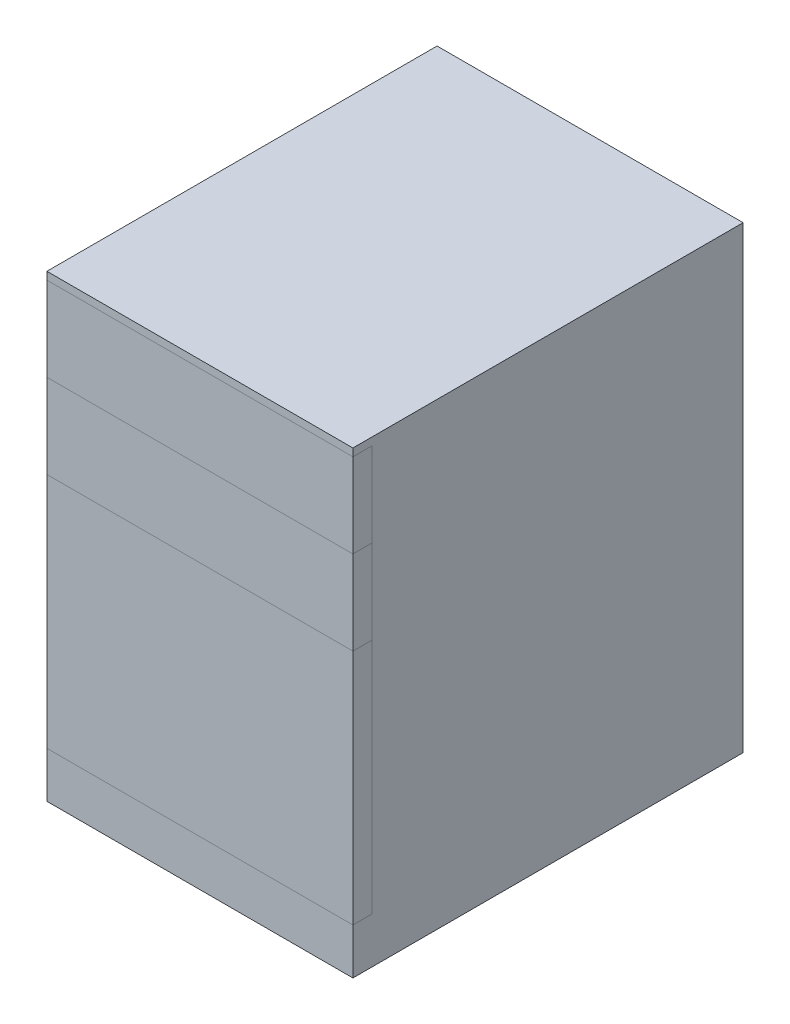
ISO-10303-21;
HEADER;
FILE_DESCRIPTION(('STEP AP214'),'2;1');
FILE_NAME('part.step','',(''),(''),'','','');
FILE_SCHEMA(('AUTOMOTIVE_DESIGN { 1 0 10303 214 1 1 1 1 }'));
ENDSEC;
DATA;
#1=APPLICATION_CONTEXT('core data for automotive mechanical design processes');
#2=APPLICATION_PROTOCOL_DEFINITION('international standard','automotive_design',2000,#1);
#3=PRODUCT_CONTEXT('',#1,'mechanical');
#4=PRODUCT('Part','Part','',(#3));
#5=PRODUCT_RELATED_PRODUCT_CATEGORY('part','',(#4));
#6=PRODUCT_DEFINITION_FORMATION('','',#4);
#7=PRODUCT_DEFINITION_CONTEXT('part definition',#1,'design');
#8=PRODUCT_DEFINITION('design','',#6,#7);
#9=PRODUCT_DEFINITION_SHAPE('','',#8);
#10=(LENGTH_UNIT() NAMED_UNIT(*) SI_UNIT(.MILLI.,.METRE.));
#11=(NAMED_UNIT(*) PLANE_ANGLE_UNIT() SI_UNIT($,.RADIAN.));
#12=(NAMED_UNIT(*) SI_UNIT($,.STERADIAN.) SOLID_ANGLE_UNIT());
#13=UNCERTAINTY_MEASURE_WITH_UNIT(LENGTH_MEASURE(1.E-05),#10,'distance_accuracy_value','');
#14=(GEOMETRIC_REPRESENTATION_CONTEXT(3) GLOBAL_UNCERTAINTY_ASSIGNED_CONTEXT((#13)) GLOBAL_UNIT_ASSIGNED_CONTEXT((#10,
#11,#12)) REPRESENTATION_CONTEXT('',''));
#15=CARTESIAN_POINT('',(0.,0.,0.));
#16=DIRECTION('',(0.,0.,1.));
#17=DIRECTION('',(1.,0.,0.));
#18=AXIS2_PLACEMENT_3D('',#15,#16,#17);
#19=CARTESIAN_POINT('',(-200.,0.,255.));
#20=DIRECTION('',(1.,0.,0.));
#21=DIRECTION('',(0.,0.,-1.));
#22=AXIS2_PLACEMENT_3D('',#19,#20,#21);
#23=PLANE('',#22);
#24=DIRECTION('',(0.,-1.,0.));
#25=VECTOR('',#24,1.);
#26=CARTESIAN_POINT('',(-200.,0.,230.));
#27=LINE('',#26,#25);
#28=CARTESIAN_POINT('',(-200.,370.,230.));
#29=VERTEX_POINT('',#28);
#30=CARTESIAN_POINT('',(-200.,59.9999999999999,230.));
#31=VERTEX_POINT('',#30);
#32=EDGE_CURVE('E114',#29,#31,#27,.T.);
#33=ORIENTED_EDGE('',*,*,#32,.T.);
#34=DIRECTION('',(0.,0.,-1.));
#35=VECTOR('',#34,1.);
#36=CARTESIAN_POINT('',(-200.,59.9999999999999,255.));
#37=LINE('',#36,#35);
#38=CARTESIAN_POINT('',(-200.,59.9999999999999,255.));
#39=VERTEX_POINT('',#38);
#40=EDGE_CURVE('E12',#39,#31,#37,.T.);
#41=ORIENTED_EDGE('',*,*,#40,.F.);
#42=DIRECTION('',(0.,-1.,0.));
#43=VECTOR('',#42,1.);
#44=CARTESIAN_POINT('',(-200.,0.,255.));
#45=LINE('',#44,#43);
#46=CARTESIAN_POINT('',(-200.,370.,255.));
#47=VERTEX_POINT('',#46);
#48=EDGE_CURVE('E91',#47,#39,#45,.T.);
#49=ORIENTED_EDGE('',*,*,#48,.F.);
#50=DIRECTION('',(0.,0.,-1.));
#51=VECTOR('',#50,1.);
#52=CARTESIAN_POINT('',(-200.,370.,255.));
#53=LINE('',#52,#51);
#54=EDGE_CURVE('E66',#47,#29,#53,.T.);
#55=ORIENTED_EDGE('',*,*,#54,.T.);
#56=EDGE_LOOP('',(#33,#41,#49,#55));
#57=FACE_BOUND('',#56,.T.);
#58=ADVANCED_FACE('F50',(#57),#23,.F.);
#59=CARTESIAN_POINT('',(0.,59.9999999999999,255.));
#60=DIRECTION('',(0.,-1.,0.));
#61=DIRECTION('',(0.,0.,-1.));
#62=AXIS2_PLACEMENT_3D('',#59,#60,#61);
#63=PLANE('',#62);
#64=DIRECTION('',(-1.,0.,0.));
#65=VECTOR('',#64,1.);
#66=CARTESIAN_POINT('',(0.,59.9999999999999,230.));
#67=LINE('',#66,#65);
#68=CARTESIAN_POINT('',(200.,59.9999999999999,230.));
#69=VERTEX_POINT('',#68);
#70=EDGE_CURVE('E101',#69,#31,#67,.T.);
#71=ORIENTED_EDGE('',*,*,#70,.F.);
#72=DIRECTION('',(0.,0.,-1.));
#73=VECTOR('',#72,1.);
#74=CARTESIAN_POINT('',(200.,59.9999999999999,255.));
#75=LINE('',#74,#73);
#76=CARTESIAN_POINT('',(200.,59.9999999999999,255.));
#77=VERTEX_POINT('',#76);
#78=EDGE_CURVE('E58',#77,#69,#75,.T.);
#79=ORIENTED_EDGE('',*,*,#78,.F.);
#80=DIRECTION('',(-1.,0.,0.));
#81=VECTOR('',#80,1.);
#82=CARTESIAN_POINT('',(0.,59.9999999999999,255.));
#83=LINE('',#82,#81);
#84=EDGE_CURVE('E99',#77,#39,#83,.T.);
#85=ORIENTED_EDGE('',*,*,#84,.T.);
#86=ORIENTED_EDGE('',*,*,#40,.T.);
#87=EDGE_LOOP('',(#71,#79,#85,#86));
#88=FACE_BOUND('',#87,.T.);
#89=ADVANCED_FACE('F98',(#88),#63,.T.);
#90=CARTESIAN_POINT('',(200.,0.,255.));
#91=DIRECTION('',(-1.,0.,0.));
#92=DIRECTION('',(0.,0.,1.));
#93=AXIS2_PLACEMENT_3D('',#90,#91,#92);
#94=PLANE('',#93);
#95=DIRECTION('',(0.,1.,0.));
#96=VECTOR('',#95,1.);
#97=CARTESIAN_POINT('',(200.,0.,230.));
#98=LINE('',#97,#96);
#99=CARTESIAN_POINT('',(200.,370.,230.));
#100=VERTEX_POINT('',#99);
#101=EDGE_CURVE('E117',#69,#100,#98,.T.);
#102=ORIENTED_EDGE('',*,*,#101,.T.);
#103=DIRECTION('',(0.,0.,-1.));
#104=VECTOR('',#103,1.);
#105=CARTESIAN_POINT('',(200.,370.,255.));
#106=LINE('',#105,#104);
#107=CARTESIAN_POINT('',(200.,370.,255.));
#108=VERTEX_POINT('',#107);
#109=EDGE_CURVE('E80',#108,#100,#106,.T.);
#110=ORIENTED_EDGE('',*,*,#109,.F.);
#111=DIRECTION('',(0.,1.,0.));
#112=VECTOR('',#111,1.);
#113=CARTESIAN_POINT('',(200.,0.,255.));
#114=LINE('',#113,#112);
#115=EDGE_CURVE('E104',#77,#108,#114,.T.);
#116=ORIENTED_EDGE('',*,*,#115,.F.);
#117=ORIENTED_EDGE('',*,*,#78,.T.);
#118=EDGE_LOOP('',(#102,#110,#116,#117));
#119=FACE_BOUND('',#118,.T.);
#120=ADVANCED_FACE('F105',(#119),#94,.F.);
#121=CARTESIAN_POINT('',(0.,370.,255.));
#122=DIRECTION('',(0.,1.,0.));
#123=DIRECTION('',(-1.,0.,0.));
#124=AXIS2_PLACEMENT_3D('',#121,#122,#123);
#125=PLANE('',#124);
#126=DIRECTION('',(1.,0.,0.));
#127=VECTOR('',#126,1.);
#128=CARTESIAN_POINT('',(0.,370.,230.));
#129=LINE('',#128,#127);
#130=EDGE_CURVE('E110',#29,#100,#129,.T.);
#131=ORIENTED_EDGE('',*,*,#130,.F.);
#132=ORIENTED_EDGE('',*,*,#54,.F.);
#133=DIRECTION('',(1.,0.,0.));
#134=VECTOR('',#133,1.);
#135=CARTESIAN_POINT('',(0.,370.,255.));
#136=LINE('',#135,#134);
#137=EDGE_CURVE('E106',#47,#108,#136,.T.);
#138=ORIENTED_EDGE('',*,*,#137,.T.);
#139=ORIENTED_EDGE('',*,*,#109,.T.);
#140=EDGE_LOOP('',(#131,#132,#138,#139));
#141=FACE_BOUND('',#140,.T.);
#142=ADVANCED_FACE('F124',(#141),#125,.T.);
#143=CARTESIAN_POINT('',(0.,0.,255.));
#144=DIRECTION('',(0.,0.,-1.));
#145=DIRECTION('',(-1.,0.,0.));
#146=AXIS2_PLACEMENT_3D('',#143,#144,#145);
#147=PLANE('',#146);
#148=ORIENTED_EDGE('',*,*,#48,.T.);
#149=ORIENTED_EDGE('',*,*,#84,.F.);
#150=ORIENTED_EDGE('',*,*,#115,.T.);
#151=ORIENTED_EDGE('',*,*,#137,.F.);
#152=EDGE_LOOP('',(#148,#149,#150,#151));
#153=FACE_BOUND('',#152,.T.);
#154=ADVANCED_FACE('F108',(#153),#147,.F.);
#155=CARTESIAN_POINT('',(0.,0.,230.));
#156=DIRECTION('',(0.,0.,-1.));
#157=DIRECTION('',(-1.,0.,0.));
#158=AXIS2_PLACEMENT_3D('',#155,#156,#157);
#159=PLANE('',#158);
#160=ORIENTED_EDGE('',*,*,#32,.F.);
#161=ORIENTED_EDGE('',*,*,#130,.T.);
#162=ORIENTED_EDGE('',*,*,#101,.F.);
#163=ORIENTED_EDGE('',*,*,#70,.T.);
#164=EDGE_LOOP('',(#160,#161,#162,#163));
#165=FACE_BOUND('',#164,.T.);
#166=ADVANCED_FACE('F123',(#165),#159,.T.);
#167=CLOSED_SHELL('',(#58,#89,#120,#142,#154,#166));
#168=MANIFOLD_SOLID_BREP('B2',#167);
#169=CARTESIAN_POINT('',(0.,480.,255.));
#170=DIRECTION('',(0.,-1.,0.));
#171=DIRECTION('',(0.,0.,-1.));
#172=AXIS2_PLACEMENT_3D('',#169,#170,#171);
#173=PLANE('',#172);
#174=DIRECTION('',(-1.,0.,0.));
#175=VECTOR('',#174,1.);
#176=CARTESIAN_POINT('',(0.,480.,230.));
#177=LINE('',#176,#175);
#178=CARTESIAN_POINT('',(200.,480.,230.));
#179=VERTEX_POINT('',#178);
#180=CARTESIAN_POINT('',(-200.,480.,230.));
#181=VERTEX_POINT('',#180);
#182=EDGE_CURVE('E247',#179,#181,#177,.T.);
#183=ORIENTED_EDGE('',*,*,#182,.T.);
#184=DIRECTION('',(0.,0.,-1.));
#185=VECTOR('',#184,1.);
#186=CARTESIAN_POINT('',(-200.,480.,255.));
#187=LINE('',#186,#185);
#188=CARTESIAN_POINT('',(-200.,480.,255.));
#189=VERTEX_POINT('',#188);
#190=EDGE_CURVE('E48',#189,#181,#187,.T.);
#191=ORIENTED_EDGE('',*,*,#190,.F.);
#192=DIRECTION('',(-1.,0.,0.));
#193=VECTOR('',#192,1.);
#194=CARTESIAN_POINT('',(0.,480.,255.));
#195=LINE('',#194,#193);
#196=CARTESIAN_POINT('',(200.,480.,255.));
#197=VERTEX_POINT('',#196);
#198=EDGE_CURVE('E235',#197,#189,#195,.T.);
#199=ORIENTED_EDGE('',*,*,#198,.F.);
#200=DIRECTION('',(0.,0.,-1.));
#201=VECTOR('',#200,1.);
#202=CARTESIAN_POINT('',(200.,480.,255.));
#203=LINE('',#202,#201);
#204=EDGE_CURVE('E243',#197,#179,#203,.T.);
#205=ORIENTED_EDGE('',*,*,#204,.T.);
#206=EDGE_LOOP('',(#183,#191,#199,#205));
#207=FACE_BOUND('',#206,.T.);
#208=ADVANCED_FACE('F184',(#207),#173,.F.);
#209=CARTESIAN_POINT('',(-200.,0.,255.));
#210=DIRECTION('',(1.,0.,0.));
#211=DIRECTION('',(0.,0.,-1.));
#212=AXIS2_PLACEMENT_3D('',#209,#210,#211);
#213=PLANE('',#212);
#214=DIRECTION('',(0.,-1.,0.));
#215=VECTOR('',#214,1.);
#216=CARTESIAN_POINT('',(-200.,0.,230.));
#217=LINE('',#216,#215);
#218=CARTESIAN_POINT('',(-200.,370.,230.));
#219=VERTEX_POINT('',#218);
#220=EDGE_CURVE('E239',#181,#219,#217,.T.);
#221=ORIENTED_EDGE('',*,*,#220,.T.);
#222=DIRECTION('',(0.,0.,-1.));
#223=VECTOR('',#222,1.);
#224=CARTESIAN_POINT('',(-200.,370.,255.));
#225=LINE('',#224,#223);
#226=CARTESIAN_POINT('',(-200.,370.,255.));
#227=VERTEX_POINT('',#226);
#228=EDGE_CURVE('E192',#227,#219,#225,.T.);
#229=ORIENTED_EDGE('',*,*,#228,.F.);
#230=DIRECTION('',(0.,-1.,0.));
#231=VECTOR('',#230,1.);
#232=CARTESIAN_POINT('',(-200.,0.,255.));
#233=LINE('',#232,#231);
#234=EDGE_CURVE('E230',#189,#227,#233,.T.);
#235=ORIENTED_EDGE('',*,*,#234,.F.);
#236=ORIENTED_EDGE('',*,*,#190,.T.);
#237=EDGE_LOOP('',(#221,#229,#235,#236));
#238=FACE_BOUND('',#237,.T.);
#239=ADVANCED_FACE('F238',(#238),#213,.F.);
#240=CARTESIAN_POINT('',(0.,370.,255.));
#241=DIRECTION('',(0.,1.,0.));
#242=DIRECTION('',(-1.,0.,0.));
#243=AXIS2_PLACEMENT_3D('',#240,#241,#242);
#244=PLANE('',#243);
#245=DIRECTION('',(1.,0.,0.));
#246=VECTOR('',#245,1.);
#247=CARTESIAN_POINT('',(0.,370.,230.));
#248=LINE('',#247,#246);
#249=CARTESIAN_POINT('',(200.,370.,230.));
#250=VERTEX_POINT('',#249);
#251=EDGE_CURVE('E217',#219,#250,#248,.T.);
#252=ORIENTED_EDGE('',*,*,#251,.T.);
#253=DIRECTION('',(0.,0.,-1.));
#254=VECTOR('',#253,1.);
#255=CARTESIAN_POINT('',(200.,370.,255.));
#256=LINE('',#255,#254);
#257=CARTESIAN_POINT('',(200.,370.,255.));
#258=VERTEX_POINT('',#257);
#259=EDGE_CURVE('E240',#258,#250,#256,.T.);
#260=ORIENTED_EDGE('',*,*,#259,.F.);
#261=DIRECTION('',(1.,0.,0.));
#262=VECTOR('',#261,1.);
#263=CARTESIAN_POINT('',(0.,370.,255.));
#264=LINE('',#263,#262);
#265=EDGE_CURVE('E233',#227,#258,#264,.T.);
#266=ORIENTED_EDGE('',*,*,#265,.F.);
#267=ORIENTED_EDGE('',*,*,#228,.T.);
#268=EDGE_LOOP('',(#252,#260,#266,#267));
#269=FACE_BOUND('',#268,.T.);
#270=ADVANCED_FACE('F241',(#269),#244,.F.);
#271=CARTESIAN_POINT('',(200.,0.,255.));
#272=DIRECTION('',(-1.,0.,0.));
#273=DIRECTION('',(0.,0.,1.));
#274=AXIS2_PLACEMENT_3D('',#271,#272,#273);
#275=PLANE('',#274);
#276=DIRECTION('',(0.,1.,0.));
#277=VECTOR('',#276,1.);
#278=CARTESIAN_POINT('',(200.,0.,230.));
#279=LINE('',#278,#277);
#280=EDGE_CURVE('E223',#250,#179,#279,.T.);
#281=ORIENTED_EDGE('',*,*,#280,.T.);
#282=ORIENTED_EDGE('',*,*,#204,.F.);
#283=DIRECTION('',(0.,1.,0.));
#284=VECTOR('',#283,1.);
#285=CARTESIAN_POINT('',(200.,0.,255.));
#286=LINE('',#285,#284);
#287=EDGE_CURVE('E200',#258,#197,#286,.T.);
#288=ORIENTED_EDGE('',*,*,#287,.F.);
#289=ORIENTED_EDGE('',*,*,#259,.T.);
#290=EDGE_LOOP('',(#281,#282,#288,#289));
#291=FACE_BOUND('',#290,.T.);
#292=ADVANCED_FACE('F254',(#291),#275,.F.);
#293=CARTESIAN_POINT('',(0.,0.,255.));
#294=DIRECTION('',(0.,0.,1.));
#295=DIRECTION('',(1.,0.,0.));
#296=AXIS2_PLACEMENT_3D('',#293,#294,#295);
#297=PLANE('',#296);
#298=ORIENTED_EDGE('',*,*,#198,.T.);
#299=ORIENTED_EDGE('',*,*,#234,.T.);
#300=ORIENTED_EDGE('',*,*,#265,.T.);
#301=ORIENTED_EDGE('',*,*,#287,.T.);
#302=EDGE_LOOP('',(#298,#299,#300,#301));
#303=FACE_BOUND('',#302,.T.);
#304=ADVANCED_FACE('F231',(#303),#297,.T.);
#305=CARTESIAN_POINT('',(0.,0.,230.));
#306=DIRECTION('',(0.,0.,1.));
#307=DIRECTION('',(1.,0.,0.));
#308=AXIS2_PLACEMENT_3D('',#305,#306,#307);
#309=PLANE('',#308);
#310=ORIENTED_EDGE('',*,*,#182,.F.);
#311=ORIENTED_EDGE('',*,*,#280,.F.);
#312=ORIENTED_EDGE('',*,*,#251,.F.);
#313=ORIENTED_EDGE('',*,*,#220,.F.);
#314=EDGE_LOOP('',(#310,#311,#312,#313));
#315=FACE_BOUND('',#314,.T.);
#316=ADVANCED_FACE('F257',(#315),#309,.F.);
#317=CLOSED_SHELL('',(#208,#239,#270,#292,#304,#316));
#318=MANIFOLD_SOLID_BREP('B6',#317);
#319=CARTESIAN_POINT('',(-200.,0.,255.));
#320=DIRECTION('',(1.,0.,0.));
#321=DIRECTION('',(0.,0.,-1.));
#322=AXIS2_PLACEMENT_3D('',#319,#320,#321);
#323=PLANE('',#322);
#324=DIRECTION('',(0.,-1.,0.));
#325=VECTOR('',#324,1.);
#326=CARTESIAN_POINT('',(-200.,0.,230.));
#327=LINE('',#326,#325);
#328=CARTESIAN_POINT('',(-200.,590.,230.));
#329=VERTEX_POINT('',#328);
#330=CARTESIAN_POINT('',(-200.,480.,230.));
#331=VERTEX_POINT('',#330);
#332=EDGE_CURVE('E381',#329,#331,#327,.T.);
#333=ORIENTED_EDGE('',*,*,#332,.T.);
#334=DIRECTION('',(0.,0.,-1.));
#335=VECTOR('',#334,1.);
#336=CARTESIAN_POINT('',(-200.,480.,255.));
#337=LINE('',#336,#335);
#338=CARTESIAN_POINT('',(-200.,480.,255.));
#339=VERTEX_POINT('',#338);
#340=EDGE_CURVE('E182',#339,#331,#337,.T.);
#341=ORIENTED_EDGE('',*,*,#340,.F.);
#342=DIRECTION('',(0.,-1.,0.));
#343=VECTOR('',#342,1.);
#344=CARTESIAN_POINT('',(-200.,0.,255.));
#345=LINE('',#344,#343);
#346=CARTESIAN_POINT('',(-200.,590.,255.));
#347=VERTEX_POINT('',#346);
#348=EDGE_CURVE('E358',#347,#339,#345,.T.);
#349=ORIENTED_EDGE('',*,*,#348,.F.);
#350=DIRECTION('',(0.,0.,-1.));
#351=VECTOR('',#350,1.);
#352=CARTESIAN_POINT('',(-200.,590.,255.));
#353=LINE('',#352,#351);
#354=EDGE_CURVE('E333',#347,#329,#353,.T.);
#355=ORIENTED_EDGE('',*,*,#354,.T.);
#356=EDGE_LOOP('',(#333,#341,#349,#355));
#357=FACE_BOUND('',#356,.T.);
#358=ADVANCED_FACE('F317',(#357),#323,.F.);
#359=CARTESIAN_POINT('',(0.,480.,255.));
#360=DIRECTION('',(0.,-1.,0.));
#361=DIRECTION('',(0.,0.,-1.));
#362=AXIS2_PLACEMENT_3D('',#359,#360,#361);
#363=PLANE('',#362);
#364=DIRECTION('',(-1.,0.,0.));
#365=VECTOR('',#364,1.);
#366=CARTESIAN_POINT('',(0.,480.,230.));
#367=LINE('',#366,#365);
#368=CARTESIAN_POINT('',(200.,480.,230.));
#369=VERTEX_POINT('',#368);
#370=EDGE_CURVE('E368',#369,#331,#367,.T.);
#371=ORIENTED_EDGE('',*,*,#370,.F.);
#372=DIRECTION('',(0.,0.,-1.));
#373=VECTOR('',#372,1.);
#374=CARTESIAN_POINT('',(200.,480.,255.));
#375=LINE('',#374,#373);
#376=CARTESIAN_POINT('',(200.,480.,255.));
#377=VERTEX_POINT('',#376);
#378=EDGE_CURVE('E325',#377,#369,#375,.T.);
#379=ORIENTED_EDGE('',*,*,#378,.F.);
#380=DIRECTION('',(-1.,0.,0.));
#381=VECTOR('',#380,1.);
#382=CARTESIAN_POINT('',(0.,480.,255.));
#383=LINE('',#382,#381);
#384=EDGE_CURVE('E366',#377,#339,#383,.T.);
#385=ORIENTED_EDGE('',*,*,#384,.T.);
#386=ORIENTED_EDGE('',*,*,#340,.T.);
#387=EDGE_LOOP('',(#371,#379,#385,#386));
#388=FACE_BOUND('',#387,.T.);
#389=ADVANCED_FACE('F365',(#388),#363,.T.);
#390=CARTESIAN_POINT('',(200.,0.,255.));
#391=DIRECTION('',(-1.,0.,0.));
#392=DIRECTION('',(0.,0.,1.));
#393=AXIS2_PLACEMENT_3D('',#390,#391,#392);
#394=PLANE('',#393);
#395=DIRECTION('',(0.,1.,0.));
#396=VECTOR('',#395,1.);
#397=CARTESIAN_POINT('',(200.,0.,230.));
#398=LINE('',#397,#396);
#399=CARTESIAN_POINT('',(200.,590.,230.));
#400=VERTEX_POINT('',#399);
#401=EDGE_CURVE('E384',#369,#400,#398,.T.);
#402=ORIENTED_EDGE('',*,*,#401,.T.);
#403=DIRECTION('',(0.,0.,-1.));
#404=VECTOR('',#403,1.);
#405=CARTESIAN_POINT('',(200.,590.,255.));
#406=LINE('',#405,#404);
#407=CARTESIAN_POINT('',(200.,590.,255.));
#408=VERTEX_POINT('',#407);
#409=EDGE_CURVE('E347',#408,#400,#406,.T.);
#410=ORIENTED_EDGE('',*,*,#409,.F.);
#411=DIRECTION('',(0.,1.,0.));
#412=VECTOR('',#411,1.);
#413=CARTESIAN_POINT('',(200.,0.,255.));
#414=LINE('',#413,#412);
#415=EDGE_CURVE('E371',#377,#408,#414,.T.);
#416=ORIENTED_EDGE('',*,*,#415,.F.);
#417=ORIENTED_EDGE('',*,*,#378,.T.);
#418=EDGE_LOOP('',(#402,#410,#416,#417));
#419=FACE_BOUND('',#418,.T.);
#420=ADVANCED_FACE('F372',(#419),#394,.F.);
#421=CARTESIAN_POINT('',(0.,590.,255.));
#422=DIRECTION('',(0.,1.,0.));
#423=DIRECTION('',(0.,0.,1.));
#424=AXIS2_PLACEMENT_3D('',#421,#422,#423);
#425=PLANE('',#424);
#426=DIRECTION('',(1.,0.,0.));
#427=VECTOR('',#426,1.);
#428=CARTESIAN_POINT('',(0.,590.,230.));
#429=LINE('',#428,#427);
#430=EDGE_CURVE('E377',#329,#400,#429,.T.);
#431=ORIENTED_EDGE('',*,*,#430,.F.);
#432=ORIENTED_EDGE('',*,*,#354,.F.);
#433=DIRECTION('',(1.,0.,0.));
#434=VECTOR('',#433,1.);
#435=CARTESIAN_POINT('',(0.,590.,255.));
#436=LINE('',#435,#434);
#437=EDGE_CURVE('E373',#347,#408,#436,.T.);
#438=ORIENTED_EDGE('',*,*,#437,.T.);
#439=ORIENTED_EDGE('',*,*,#409,.T.);
#440=EDGE_LOOP('',(#431,#432,#438,#439));
#441=FACE_BOUND('',#440,.T.);
#442=ADVANCED_FACE('F391',(#441),#425,.T.);
#443=CARTESIAN_POINT('',(0.,0.,255.));
#444=DIRECTION('',(0.,0.,-1.));
#445=DIRECTION('',(-1.,0.,0.));
#446=AXIS2_PLACEMENT_3D('',#443,#444,#445);
#447=PLANE('',#446);
#448=ORIENTED_EDGE('',*,*,#348,.T.);
#449=ORIENTED_EDGE('',*,*,#384,.F.);
#450=ORIENTED_EDGE('',*,*,#415,.T.);
#451=ORIENTED_EDGE('',*,*,#437,.F.);
#452=EDGE_LOOP('',(#448,#449,#450,#451));
#453=FACE_BOUND('',#452,.T.);
#454=ADVANCED_FACE('F375',(#453),#447,.F.);
#455=CARTESIAN_POINT('',(0.,0.,230.));
#456=DIRECTION('',(0.,0.,-1.));
#457=DIRECTION('',(-1.,0.,0.));
#458=AXIS2_PLACEMENT_3D('',#455,#456,#457);
#459=PLANE('',#458);
#460=ORIENTED_EDGE('',*,*,#332,.F.);
#461=ORIENTED_EDGE('',*,*,#430,.T.);
#462=ORIENTED_EDGE('',*,*,#401,.F.);
#463=ORIENTED_EDGE('',*,*,#370,.T.);
#464=EDGE_LOOP('',(#460,#461,#462,#463));
#465=FACE_BOUND('',#464,.T.);
#466=ADVANCED_FACE('F390',(#465),#459,.T.);
#467=CLOSED_SHELL('',(#358,#389,#420,#442,#454,#466));
#468=MANIFOLD_SOLID_BREP('B42',#467);
#469=CARTESIAN_POINT('',(200.,600.,255.));
#470=DIRECTION('',(-1.,0.,0.));
#471=DIRECTION('',(0.,0.,1.));
#472=AXIS2_PLACEMENT_3D('',#469,#470,#471);
#473=PLANE('',#472);
#474=DIRECTION('',(0.,0.,1.));
#475=VECTOR('',#474,1.);
#476=CARTESIAN_POINT('',(200.,590.,230.));
#477=LINE('',#476,#475);
#478=CARTESIAN_POINT('',(200.,590.,230.));
#479=VERTEX_POINT('',#478);
#480=CARTESIAN_POINT('',(200.,590.,255.));
#481=VERTEX_POINT('',#480);
#482=EDGE_CURVE('E542',#479,#481,#477,.T.);
#483=ORIENTED_EDGE('',*,*,#482,.F.);
#484=DIRECTION('',(0.,1.,0.));
#485=VECTOR('',#484,1.);
#486=CARTESIAN_POINT('',(200.,0.,230.));
#487=LINE('',#486,#485);
#488=CARTESIAN_POINT('',(200.,59.9999999999999,230.));
#489=VERTEX_POINT('',#488);
#490=EDGE_CURVE('E522',#489,#479,#487,.T.);
#491=ORIENTED_EDGE('',*,*,#490,.F.);
#492=DIRECTION('',(0.,0.,1.));
#493=VECTOR('',#492,1.);
#494=CARTESIAN_POINT('',(200.,59.9999999999999,230.));
#495=LINE('',#494,#493);
#496=CARTESIAN_POINT('',(200.,59.9999999999999,255.));
#497=VERTEX_POINT('',#496);
#498=EDGE_CURVE('E517',#489,#497,#495,.T.);
#499=ORIENTED_EDGE('',*,*,#498,.T.);
#500=DIRECTION('',(0.,-1.,0.));
#501=VECTOR('',#500,1.);
#502=CARTESIAN_POINT('',(200.,600.,255.));
#503=LINE('',#502,#501);
#504=CARTESIAN_POINT('',(200.,0.,255.));
#505=VERTEX_POINT('',#504);
#506=EDGE_CURVE('E487',#497,#505,#503,.T.);
#507=ORIENTED_EDGE('',*,*,#506,.T.);
#508=DIRECTION('',(0.,0.,-1.));
#509=VECTOR('',#508,1.);
#510=CARTESIAN_POINT('',(200.,0.,255.));
#511=LINE('',#510,#509);
#512=CARTESIAN_POINT('',(200.,0.,-255.));
#513=VERTEX_POINT('',#512);
#514=EDGE_CURVE('E558',#505,#513,#511,.T.);
#515=ORIENTED_EDGE('',*,*,#514,.T.);
#516=DIRECTION('',(0.,-1.,0.));
#517=VECTOR('',#516,1.);
#518=CARTESIAN_POINT('',(200.,600.,-255.));
#519=LINE('',#518,#517);
#520=CARTESIAN_POINT('',(200.,600.,-255.));
#521=VERTEX_POINT('',#520);
#522=EDGE_CURVE('E315',#521,#513,#519,.T.);
#523=ORIENTED_EDGE('',*,*,#522,.F.);
#524=DIRECTION('',(0.,0.,-1.));
#525=VECTOR('',#524,1.);
#526=CARTESIAN_POINT('',(200.,600.,255.));
#527=LINE('',#526,#525);
#528=CARTESIAN_POINT('',(200.,600.,255.));
#529=VERTEX_POINT('',#528);
#530=EDGE_CURVE('E547',#529,#521,#527,.T.);
#531=ORIENTED_EDGE('',*,*,#530,.F.);
#532=EDGE_CURVE('E570',#529,#481,#503,.T.);
#533=ORIENTED_EDGE('',*,*,#532,.T.);
#534=EDGE_LOOP('',(#483,#491,#499,#507,#515,#523,#531,#533));
#535=FACE_BOUND('',#534,.T.);
#536=ADVANCED_FACE('F441',(#535),#473,.F.);
#537=CARTESIAN_POINT('',(-200.,600.,255.));
#538=DIRECTION('',(1.,0.,0.));
#539=DIRECTION('',(0.,0.,-1.));
#540=AXIS2_PLACEMENT_3D('',#537,#538,#539);
#541=PLANE('',#540);
#542=DIRECTION('',(0.,0.,1.));
#543=VECTOR('',#542,1.);
#544=CARTESIAN_POINT('',(-200.,590.,230.));
#545=LINE('',#544,#543);
#546=CARTESIAN_POINT('',(-200.,590.,230.));
#547=VERTEX_POINT('',#546);
#548=CARTESIAN_POINT('',(-200.,590.,255.));
#549=VERTEX_POINT('',#548);
#550=EDGE_CURVE('E562',#547,#549,#545,.T.);
#551=ORIENTED_EDGE('',*,*,#550,.T.);
#552=DIRECTION('',(0.,-1.,0.));
#553=VECTOR('',#552,1.);
#554=CARTESIAN_POINT('',(-200.,600.,255.));
#555=LINE('',#554,#553);
#556=CARTESIAN_POINT('',(-200.,600.,255.));
#557=VERTEX_POINT('',#556);
#558=EDGE_CURVE('E574',#557,#549,#555,.T.);
#559=ORIENTED_EDGE('',*,*,#558,.F.);
#560=DIRECTION('',(0.,0.,1.));
#561=VECTOR('',#560,1.);
#562=CARTESIAN_POINT('',(-200.,600.,255.));
#563=LINE('',#562,#561);
#564=CARTESIAN_POINT('',(-200.,600.,-255.));
#565=VERTEX_POINT('',#564);
#566=EDGE_CURVE('E553',#565,#557,#563,.T.);
#567=ORIENTED_EDGE('',*,*,#566,.F.);
#568=DIRECTION('',(0.,-1.,0.));
#569=VECTOR('',#568,1.);
#570=CARTESIAN_POINT('',(-200.,600.,-255.));
#571=LINE('',#570,#569);
#572=CARTESIAN_POINT('',(-200.,0.,-255.));
#573=VERTEX_POINT('',#572);
#574=EDGE_CURVE('E449',#565,#573,#571,.T.);
#575=ORIENTED_EDGE('',*,*,#574,.T.);
#576=DIRECTION('',(0.,0.,1.));
#577=VECTOR('',#576,1.);
#578=CARTESIAN_POINT('',(-200.,0.,255.));
#579=LINE('',#578,#577);
#580=CARTESIAN_POINT('',(-200.,0.,255.));
#581=VERTEX_POINT('',#580);
#582=EDGE_CURVE('E565',#573,#581,#579,.T.);
#583=ORIENTED_EDGE('',*,*,#582,.T.);
#584=CARTESIAN_POINT('',(-200.,59.9999999999999,255.));
#585=VERTEX_POINT('',#584);
#586=EDGE_CURVE('E537',#585,#581,#555,.T.);
#587=ORIENTED_EDGE('',*,*,#586,.F.);
#588=DIRECTION('',(0.,0.,1.));
#589=VECTOR('',#588,1.);
#590=CARTESIAN_POINT('',(-200.,59.9999999999999,230.));
#591=LINE('',#590,#589);
#592=CARTESIAN_POINT('',(-200.,59.9999999999999,230.));
#593=VERTEX_POINT('',#592);
#594=EDGE_CURVE('E456',#593,#585,#591,.T.);
#595=ORIENTED_EDGE('',*,*,#594,.F.);
#596=DIRECTION('',(0.,-1.,0.));
#597=VECTOR('',#596,1.);
#598=CARTESIAN_POINT('',(-200.,0.,230.));
#599=LINE('',#598,#597);
#600=EDGE_CURVE('E523',#547,#593,#599,.T.);
#601=ORIENTED_EDGE('',*,*,#600,.F.);
#602=EDGE_LOOP('',(#551,#559,#567,#575,#583,#587,#595,#601));
#603=FACE_BOUND('',#602,.T.);
#604=ADVANCED_FACE('F535',(#603),#541,.F.);
#605=CARTESIAN_POINT('',(-200.,600.,255.));
#606=DIRECTION('',(0.,0.,-1.));
#607=DIRECTION('',(-1.,0.,0.));
#608=AXIS2_PLACEMENT_3D('',#605,#606,#607);
#609=PLANE('',#608);
#610=DIRECTION('',(1.,0.,0.));
#611=VECTOR('',#610,1.);
#612=CARTESIAN_POINT('',(0.,590.,255.));
#613=LINE('',#612,#611);
#614=EDGE_CURVE('E532',#549,#481,#613,.T.);
#615=ORIENTED_EDGE('',*,*,#614,.T.);
#616=ORIENTED_EDGE('',*,*,#532,.F.);
#617=DIRECTION('',(1.,0.,0.));
#618=VECTOR('',#617,1.);
#619=CARTESIAN_POINT('',(-200.,600.,255.));
#620=LINE('',#619,#618);
#621=EDGE_CURVE('E465',#557,#529,#620,.T.);
#622=ORIENTED_EDGE('',*,*,#621,.F.);
#623=ORIENTED_EDGE('',*,*,#558,.T.);
#624=EDGE_LOOP('',(#615,#616,#622,#623));
#625=FACE_BOUND('',#624,.T.);
#626=ADVANCED_FACE('F606',(#625),#609,.F.);
#627=DIRECTION('',(-1.,0.,0.));
#628=VECTOR('',#627,1.);
#629=CARTESIAN_POINT('',(0.,59.9999999999999,255.));
#630=LINE('',#629,#628);
#631=EDGE_CURVE('E588',#497,#585,#630,.T.);
#632=ORIENTED_EDGE('',*,*,#631,.T.);
#633=ORIENTED_EDGE('',*,*,#586,.T.);
#634=DIRECTION('',(1.,0.,0.));
#635=VECTOR('',#634,1.);
#636=CARTESIAN_POINT('',(-200.,0.,255.));
#637=LINE('',#636,#635);
#638=EDGE_CURVE('E550',#581,#505,#637,.T.);
#639=ORIENTED_EDGE('',*,*,#638,.T.);
#640=ORIENTED_EDGE('',*,*,#506,.F.);
#641=EDGE_LOOP('',(#632,#633,#639,#640));
#642=FACE_BOUND('',#641,.T.);
#643=ADVANCED_FACE('F587',(#642),#609,.F.);
#644=CARTESIAN_POINT('',(-200.,600.,-255.));
#645=DIRECTION('',(0.,0.,1.));
#646=DIRECTION('',(1.,0.,0.));
#647=AXIS2_PLACEMENT_3D('',#644,#645,#646);
#648=PLANE('',#647);
#649=DIRECTION('',(-1.,0.,0.));
#650=VECTOR('',#649,1.);
#651=CARTESIAN_POINT('',(-200.,0.,-255.));
#652=LINE('',#651,#650);
#653=EDGE_CURVE('E561',#513,#573,#652,.T.);
#654=ORIENTED_EDGE('',*,*,#653,.T.);
#655=ORIENTED_EDGE('',*,*,#574,.F.);
#656=DIRECTION('',(-1.,0.,0.));
#657=VECTOR('',#656,1.);
#658=CARTESIAN_POINT('',(-200.,600.,-255.));
#659=LINE('',#658,#657);
#660=EDGE_CURVE('E494',#521,#565,#659,.T.);
#661=ORIENTED_EDGE('',*,*,#660,.F.);
#662=ORIENTED_EDGE('',*,*,#522,.T.);
#663=EDGE_LOOP('',(#654,#655,#661,#662));
#664=FACE_BOUND('',#663,.T.);
#665=ADVANCED_FACE('F627',(#664),#648,.F.);
#666=CARTESIAN_POINT('',(0.,600.,0.));
#667=DIRECTION('',(0.,-1.,0.));
#668=DIRECTION('',(0.,0.,-1.));
#669=AXIS2_PLACEMENT_3D('',#666,#667,#668);
#670=PLANE('',#669);
#671=ORIENTED_EDGE('',*,*,#530,.T.);
#672=ORIENTED_EDGE('',*,*,#660,.T.);
#673=ORIENTED_EDGE('',*,*,#566,.T.);
#674=ORIENTED_EDGE('',*,*,#621,.T.);
#675=EDGE_LOOP('',(#671,#672,#673,#674));
#676=FACE_BOUND('',#675,.T.);
#677=ADVANCED_FACE('F615',(#676),#670,.F.);
#678=CARTESIAN_POINT('',(0.,0.,0.));
#679=DIRECTION('',(0.,-1.,0.));
#680=DIRECTION('',(0.,0.,-1.));
#681=AXIS2_PLACEMENT_3D('',#678,#679,#680);
#682=PLANE('',#681);
#683=ORIENTED_EDGE('',*,*,#514,.F.);
#684=ORIENTED_EDGE('',*,*,#638,.F.);
#685=ORIENTED_EDGE('',*,*,#582,.F.);
#686=ORIENTED_EDGE('',*,*,#653,.F.);
#687=EDGE_LOOP('',(#683,#684,#685,#686));
#688=FACE_BOUND('',#687,.T.);
#689=ADVANCED_FACE('F585',(#688),#682,.T.);
#690=CARTESIAN_POINT('',(0.,590.,230.));
#691=DIRECTION('',(0.,-1.,0.));
#692=DIRECTION('',(0.,0.,-1.));
#693=AXIS2_PLACEMENT_3D('',#690,#691,#692);
#694=PLANE('',#693);
#695=ORIENTED_EDGE('',*,*,#614,.F.);
#696=ORIENTED_EDGE('',*,*,#550,.F.);
#697=DIRECTION('',(1.,0.,0.));
#698=VECTOR('',#697,1.);
#699=CARTESIAN_POINT('',(0.,590.,230.));
#700=LINE('',#699,#698);
#701=EDGE_CURVE('E528',#547,#479,#700,.T.);
#702=ORIENTED_EDGE('',*,*,#701,.T.);
#703=ORIENTED_EDGE('',*,*,#482,.T.);
#704=EDGE_LOOP('',(#695,#696,#702,#703));
#705=FACE_BOUND('',#704,.T.);
#706=ADVANCED_FACE('F607',(#705),#694,.T.);
#707=CARTESIAN_POINT('',(0.,59.9999999999999,230.));
#708=DIRECTION('',(0.,1.,0.));
#709=DIRECTION('',(0.,0.,1.));
#710=AXIS2_PLACEMENT_3D('',#707,#708,#709);
#711=PLANE('',#710);
#712=ORIENTED_EDGE('',*,*,#631,.F.);
#713=ORIENTED_EDGE('',*,*,#498,.F.);
#714=DIRECTION('',(-1.,0.,0.));
#715=VECTOR('',#714,1.);
#716=CARTESIAN_POINT('',(0.,59.9999999999999,230.));
#717=LINE('',#716,#715);
#718=EDGE_CURVE('E514',#489,#593,#717,.T.);
#719=ORIENTED_EDGE('',*,*,#718,.T.);
#720=ORIENTED_EDGE('',*,*,#594,.T.);
#721=EDGE_LOOP('',(#712,#713,#719,#720));
#722=FACE_BOUND('',#721,.T.);
#723=ADVANCED_FACE('F516',(#722),#711,.T.);
#724=CARTESIAN_POINT('',(0.,0.,230.));
#725=DIRECTION('',(0.,0.,1.));
#726=DIRECTION('',(1.,0.,0.));
#727=AXIS2_PLACEMENT_3D('',#724,#725,#726);
#728=PLANE('',#727);
#729=ORIENTED_EDGE('',*,*,#600,.T.);
#730=ORIENTED_EDGE('',*,*,#718,.F.);
#731=ORIENTED_EDGE('',*,*,#490,.T.);
#732=ORIENTED_EDGE('',*,*,#701,.F.);
#733=EDGE_LOOP('',(#729,#730,#731,#732));
#734=FACE_BOUND('',#733,.T.);
#735=ADVANCED_FACE('F527',(#734),#728,.T.);
#736=CLOSED_SHELL('',(#536,#604,#626,#643,#665,#677,#689,#706,#723,#735));
#737=MANIFOLD_SOLID_BREP('B176',#736);
#738=ADVANCED_BREP_SHAPE_REPRESENTATION('',(#18,#168,#318,#468,#737),#14);
#739=SHAPE_DEFINITION_REPRESENTATION(#9,#738);
ENDSEC;
END-ISO-10303-21;
